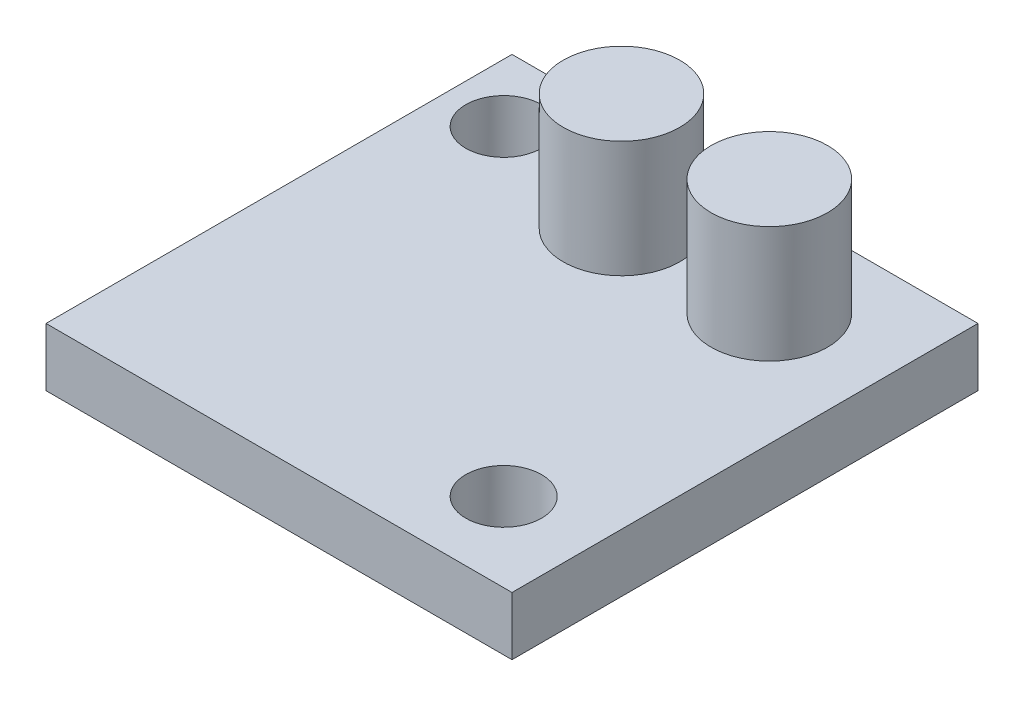
ISO-10303-21;
HEADER;
FILE_DESCRIPTION(('STEP AP214'),'2;1');
FILE_NAME('part.step','',(''),(''),'','','');
FILE_SCHEMA(('AUTOMOTIVE_DESIGN { 1 0 10303 214 1 1 1 1 }'));
ENDSEC;
DATA;
#1=APPLICATION_CONTEXT('core data for automotive mechanical design processes');
#2=APPLICATION_PROTOCOL_DEFINITION('international standard','automotive_design',2000,#1);
#3=PRODUCT_CONTEXT('',#1,'mechanical');
#4=PRODUCT('Part','Part','',(#3));
#5=PRODUCT_RELATED_PRODUCT_CATEGORY('part','',(#4));
#6=PRODUCT_DEFINITION_FORMATION('','',#4);
#7=PRODUCT_DEFINITION_CONTEXT('part definition',#1,'design');
#8=PRODUCT_DEFINITION('design','',#6,#7);
#9=PRODUCT_DEFINITION_SHAPE('','',#8);
#10=(LENGTH_UNIT() NAMED_UNIT(*) SI_UNIT(.MILLI.,.METRE.));
#11=(NAMED_UNIT(*) PLANE_ANGLE_UNIT() SI_UNIT($,.RADIAN.));
#12=(NAMED_UNIT(*) SI_UNIT($,.STERADIAN.) SOLID_ANGLE_UNIT());
#13=UNCERTAINTY_MEASURE_WITH_UNIT(LENGTH_MEASURE(1.E-05),#10,'distance_accuracy_value','');
#14=(GEOMETRIC_REPRESENTATION_CONTEXT(3) GLOBAL_UNCERTAINTY_ASSIGNED_CONTEXT((#13)) GLOBAL_UNIT_ASSIGNED_CONTEXT((#10,
#11,#12)) REPRESENTATION_CONTEXT('',''));
#15=CARTESIAN_POINT('',(0.,0.,0.));
#16=DIRECTION('',(0.,0.,1.));
#17=DIRECTION('',(1.,0.,0.));
#18=AXIS2_PLACEMENT_3D('',#15,#16,#17);
#19=CARTESIAN_POINT('',(0.,2.54,0.));
#20=DIRECTION('',(1.,0.,0.));
#21=DIRECTION('',(0.,0.,-1.));
#22=AXIS2_PLACEMENT_3D('',#19,#20,#21);
#23=PLANE('',#22);
#24=DIRECTION('',(0.,0.,1.));
#25=VECTOR('',#24,1.);
#26=CARTESIAN_POINT('',(0.,0.,0.));
#27=LINE('',#26,#25);
#28=CARTESIAN_POINT('',(0.,0.,-20.32));
#29=VERTEX_POINT('',#28);
#30=CARTESIAN_POINT('',(0.,0.,0.));
#31=VERTEX_POINT('',#30);
#32=EDGE_CURVE('E101',#29,#31,#27,.T.);
#33=ORIENTED_EDGE('',*,*,#32,.T.);
#34=DIRECTION('',(0.,-1.,0.));
#35=VECTOR('',#34,1.);
#36=CARTESIAN_POINT('',(0.,2.54,0.));
#37=LINE('',#36,#35);
#38=CARTESIAN_POINT('',(0.,2.54,0.));
#39=VERTEX_POINT('',#38);
#40=EDGE_CURVE('E92',#39,#31,#37,.T.);
#41=ORIENTED_EDGE('',*,*,#40,.F.);
#42=DIRECTION('',(0.,0.,1.));
#43=VECTOR('',#42,1.);
#44=CARTESIAN_POINT('',(0.,2.54,0.));
#45=LINE('',#44,#43);
#46=CARTESIAN_POINT('',(0.,2.54,-20.32));
#47=VERTEX_POINT('',#46);
#48=EDGE_CURVE('E86',#47,#39,#45,.T.);
#49=ORIENTED_EDGE('',*,*,#48,.F.);
#50=DIRECTION('',(0.,-1.,0.));
#51=VECTOR('',#50,1.);
#52=CARTESIAN_POINT('',(0.,2.54,-20.32));
#53=LINE('',#52,#51);
#54=EDGE_CURVE('E97',#47,#29,#53,.T.);
#55=ORIENTED_EDGE('',*,*,#54,.T.);
#56=EDGE_LOOP('',(#33,#41,#49,#55));
#57=FACE_BOUND('',#56,.T.);
#58=ADVANCED_FACE('F34',(#57),#23,.F.);
#59=CARTESIAN_POINT('',(0.,2.54,0.));
#60=DIRECTION('',(0.,0.,-1.));
#61=DIRECTION('',(-1.,0.,0.));
#62=AXIS2_PLACEMENT_3D('',#59,#60,#61);
#63=PLANE('',#62);
#64=DIRECTION('',(1.,0.,0.));
#65=VECTOR('',#64,1.);
#66=CARTESIAN_POINT('',(0.,0.,0.));
#67=LINE('',#66,#65);
#68=CARTESIAN_POINT('',(20.32,0.,0.));
#69=VERTEX_POINT('',#68);
#70=EDGE_CURVE('E91',#31,#69,#67,.T.);
#71=ORIENTED_EDGE('',*,*,#70,.T.);
#72=DIRECTION('',(0.,-1.,0.));
#73=VECTOR('',#72,1.);
#74=CARTESIAN_POINT('',(20.32,2.54,0.));
#75=LINE('',#74,#73);
#76=CARTESIAN_POINT('',(20.32,2.54,0.));
#77=VERTEX_POINT('',#76);
#78=EDGE_CURVE('E89',#77,#69,#75,.T.);
#79=ORIENTED_EDGE('',*,*,#78,.F.);
#80=DIRECTION('',(1.,0.,0.));
#81=VECTOR('',#80,1.);
#82=CARTESIAN_POINT('',(0.,2.54,0.));
#83=LINE('',#82,#81);
#84=EDGE_CURVE('E81',#39,#77,#83,.T.);
#85=ORIENTED_EDGE('',*,*,#84,.F.);
#86=ORIENTED_EDGE('',*,*,#40,.T.);
#87=EDGE_LOOP('',(#71,#79,#85,#86));
#88=FACE_BOUND('',#87,.T.);
#89=ADVANCED_FACE('F90',(#88),#63,.F.);
#90=CARTESIAN_POINT('',(20.32,2.54,0.));
#91=DIRECTION('',(-1.,0.,0.));
#92=DIRECTION('',(0.,0.,1.));
#93=AXIS2_PLACEMENT_3D('',#90,#91,#92);
#94=PLANE('',#93);
#95=DIRECTION('',(0.,0.,-1.));
#96=VECTOR('',#95,1.);
#97=CARTESIAN_POINT('',(20.32,0.,0.));
#98=LINE('',#97,#96);
#99=CARTESIAN_POINT('',(20.32,0.,-20.32));
#100=VERTEX_POINT('',#99);
#101=EDGE_CURVE('E67',#69,#100,#98,.T.);
#102=ORIENTED_EDGE('',*,*,#101,.T.);
#103=DIRECTION('',(0.,-1.,0.));
#104=VECTOR('',#103,1.);
#105=CARTESIAN_POINT('',(20.32,2.54,-20.32));
#106=LINE('',#105,#104);
#107=CARTESIAN_POINT('',(20.32,2.54,-20.32));
#108=VERTEX_POINT('',#107);
#109=EDGE_CURVE('E93',#108,#100,#106,.T.);
#110=ORIENTED_EDGE('',*,*,#109,.F.);
#111=DIRECTION('',(0.,0.,-1.));
#112=VECTOR('',#111,1.);
#113=CARTESIAN_POINT('',(20.32,2.54,0.));
#114=LINE('',#113,#112);
#115=EDGE_CURVE('E84',#77,#108,#114,.T.);
#116=ORIENTED_EDGE('',*,*,#115,.F.);
#117=ORIENTED_EDGE('',*,*,#78,.T.);
#118=EDGE_LOOP('',(#102,#110,#116,#117));
#119=FACE_BOUND('',#118,.T.);
#120=ADVANCED_FACE('F95',(#119),#94,.F.);
#121=CARTESIAN_POINT('',(0.,2.54,-20.32));
#122=DIRECTION('',(0.,0.,1.));
#123=DIRECTION('',(1.,0.,0.));
#124=AXIS2_PLACEMENT_3D('',#121,#122,#123);
#125=PLANE('',#124);
#126=DIRECTION('',(-1.,0.,0.));
#127=VECTOR('',#126,1.);
#128=CARTESIAN_POINT('',(0.,0.,-20.32));
#129=LINE('',#128,#127);
#130=EDGE_CURVE('E73',#100,#29,#129,.T.);
#131=ORIENTED_EDGE('',*,*,#130,.T.);
#132=ORIENTED_EDGE('',*,*,#54,.F.);
#133=DIRECTION('',(-1.,0.,0.));
#134=VECTOR('',#133,1.);
#135=CARTESIAN_POINT('',(0.,2.54,-20.32));
#136=LINE('',#135,#134);
#137=EDGE_CURVE('E50',#108,#47,#136,.T.);
#138=ORIENTED_EDGE('',*,*,#137,.F.);
#139=ORIENTED_EDGE('',*,*,#109,.T.);
#140=EDGE_LOOP('',(#131,#132,#138,#139));
#141=FACE_BOUND('',#140,.T.);
#142=ADVANCED_FACE('F118',(#141),#125,.F.);
#143=CARTESIAN_POINT('',(0.,2.54,0.));
#144=DIRECTION('',(0.,-1.,0.));
#145=DIRECTION('',(0.,0.,-1.));
#146=AXIS2_PLACEMENT_3D('',#143,#144,#145);
#147=PLANE('',#146);
#148=CARTESIAN_POINT('',(15.3999132319201,2.54,-16.1410851693299));
#149=DIRECTION('',(0.,-1.,0.));
#150=DIRECTION('',(0.,0.,-1.));
#151=AXIS2_PLACEMENT_3D('',#148,#149,#150);
#152=CIRCLE('',#151,2.54);
#153=CARTESIAN_POINT('',(15.3999132319201,2.54,-18.6810851693299));
#154=VERTEX_POINT('',#153);
#155=EDGE_CURVE('E11',#154,#154,#152,.F.);
#156=ORIENTED_EDGE('',*,*,#155,.F.);
#157=EDGE_LOOP('',(#156));
#158=FACE_BOUND('',#157,.T.);
#159=CARTESIAN_POINT('',(8.95344103212366,2.54,-16.1410851693299));
#160=DIRECTION('',(0.,-1.,0.));
#161=DIRECTION('',(0.,0.,-1.));
#162=AXIS2_PLACEMENT_3D('',#159,#160,#161);
#163=CIRCLE('',#162,2.54);
#164=CARTESIAN_POINT('',(8.95344103212366,2.54,-18.6810851693299));
#165=VERTEX_POINT('',#164);
#166=EDGE_CURVE('E42',#165,#165,#163,.F.);
#167=ORIENTED_EDGE('',*,*,#166,.F.);
#168=EDGE_LOOP('',(#167));
#169=FACE_BOUND('',#168,.T.);
#170=CARTESIAN_POINT('',(16.51,2.54,-3.44659036394201));
#171=DIRECTION('',(0.,1.,0.));
#172=DIRECTION('',(0.,0.,1.));
#173=AXIS2_PLACEMENT_3D('',#170,#171,#172);
#174=CIRCLE('',#173,1.651);
#175=CARTESIAN_POINT('',(16.51,2.54,-1.79559036394201));
#176=VERTEX_POINT('',#175);
#177=EDGE_CURVE('E124',#176,#176,#174,.T.);
#178=ORIENTED_EDGE('',*,*,#177,.F.);
#179=EDGE_LOOP('',(#178));
#180=FACE_BOUND('',#179,.T.);
#181=CARTESIAN_POINT('',(2.54,2.54,-17.416590363942));
#182=DIRECTION('',(0.,1.,0.));
#183=DIRECTION('',(0.,0.,1.));
#184=AXIS2_PLACEMENT_3D('',#181,#182,#183);
#185=CIRCLE('',#184,1.651);
#186=CARTESIAN_POINT('',(2.54,2.54,-15.765590363942));
#187=VERTEX_POINT('',#186);
#188=EDGE_CURVE('E104',#187,#187,#185,.T.);
#189=ORIENTED_EDGE('',*,*,#188,.F.);
#190=EDGE_LOOP('',(#189));
#191=FACE_BOUND('',#190,.T.);
#192=ORIENTED_EDGE('',*,*,#48,.T.);
#193=ORIENTED_EDGE('',*,*,#84,.T.);
#194=ORIENTED_EDGE('',*,*,#115,.T.);
#195=ORIENTED_EDGE('',*,*,#137,.T.);
#196=EDGE_LOOP('',(#192,#193,#194,#195));
#197=FACE_BOUND('',#196,.T.);
#198=ADVANCED_FACE('F82',(#158,#169,#180,#191,#197),#147,.F.);
#199=CARTESIAN_POINT('',(0.,0.,0.));
#200=DIRECTION('',(0.,-1.,0.));
#201=DIRECTION('',(0.,0.,-1.));
#202=AXIS2_PLACEMENT_3D('',#199,#200,#201);
#203=PLANE('',#202);
#204=CARTESIAN_POINT('',(16.51,0.,-3.44659036394201));
#205=DIRECTION('',(0.,-1.,0.));
#206=DIRECTION('',(0.,0.,-1.));
#207=AXIS2_PLACEMENT_3D('',#204,#205,#206);
#208=CIRCLE('',#207,1.651);
#209=CARTESIAN_POINT('',(16.51,0.,-5.09759036394201));
#210=VERTEX_POINT('',#209);
#211=EDGE_CURVE('E133',#210,#210,#208,.F.);
#212=ORIENTED_EDGE('',*,*,#211,.T.);
#213=EDGE_LOOP('',(#212));
#214=FACE_BOUND('',#213,.T.);
#215=CARTESIAN_POINT('',(2.54,0.,-17.416590363942));
#216=DIRECTION('',(0.,-1.,0.));
#217=DIRECTION('',(0.,0.,-1.));
#218=AXIS2_PLACEMENT_3D('',#215,#216,#217);
#219=CIRCLE('',#218,1.651);
#220=CARTESIAN_POINT('',(2.54,0.,-19.067590363942));
#221=VERTEX_POINT('',#220);
#222=EDGE_CURVE('E128',#221,#221,#219,.F.);
#223=ORIENTED_EDGE('',*,*,#222,.T.);
#224=EDGE_LOOP('',(#223));
#225=FACE_BOUND('',#224,.T.);
#226=ORIENTED_EDGE('',*,*,#32,.F.);
#227=ORIENTED_EDGE('',*,*,#130,.F.);
#228=ORIENTED_EDGE('',*,*,#101,.F.);
#229=ORIENTED_EDGE('',*,*,#70,.F.);
#230=EDGE_LOOP('',(#226,#227,#228,#229));
#231=FACE_BOUND('',#230,.T.);
#232=ADVANCED_FACE('F117',(#214,#225,#231),#203,.T.);
#233=CARTESIAN_POINT('',(2.54,-0.00100000000000013,-17.416590363942));
#234=DIRECTION('',(0.,1.,0.));
#235=DIRECTION('',(0.,0.,1.));
#236=AXIS2_PLACEMENT_3D('',#233,#234,#235);
#237=CYLINDRICAL_SURFACE('',#236,1.651);
#238=ORIENTED_EDGE('',*,*,#222,.F.);
#239=EDGE_LOOP('',(#238));
#240=FACE_BOUND('',#239,.T.);
#241=ORIENTED_EDGE('',*,*,#188,.T.);
#242=EDGE_LOOP('',(#241));
#243=FACE_BOUND('',#242,.T.);
#244=ADVANCED_FACE('F167',(#240,#243),#237,.F.);
#245=CARTESIAN_POINT('',(16.51,-0.00100000000000013,-3.44659036394201));
#246=DIRECTION('',(0.,1.,0.));
#247=DIRECTION('',(0.,0.,1.));
#248=AXIS2_PLACEMENT_3D('',#245,#246,#247);
#249=CYLINDRICAL_SURFACE('',#248,1.651);
#250=ORIENTED_EDGE('',*,*,#211,.F.);
#251=EDGE_LOOP('',(#250));
#252=FACE_BOUND('',#251,.T.);
#253=ORIENTED_EDGE('',*,*,#177,.T.);
#254=EDGE_LOOP('',(#253));
#255=FACE_BOUND('',#254,.T.);
#256=ADVANCED_FACE('F173',(#252,#255),#249,.F.);
#257=CARTESIAN_POINT('',(8.95344103212366,7.62,-16.1410851693299));
#258=DIRECTION('',(0.,-1.,0.));
#259=DIRECTION('',(0.,0.,-1.));
#260=AXIS2_PLACEMENT_3D('',#257,#258,#259);
#261=CYLINDRICAL_SURFACE('',#260,2.54);
#262=CARTESIAN_POINT('',(8.95344103212366,7.62,-16.1410851693299));
#263=DIRECTION('',(0.,1.,0.));
#264=DIRECTION('',(0.,0.,1.));
#265=AXIS2_PLACEMENT_3D('',#262,#263,#264);
#266=CIRCLE('',#265,2.54);
#267=CARTESIAN_POINT('',(8.95344103212366,7.62,-13.6010851693299));
#268=VERTEX_POINT('',#267);
#269=EDGE_CURVE('E136',#268,#268,#266,.T.);
#270=ORIENTED_EDGE('',*,*,#269,.F.);
#271=EDGE_LOOP('',(#270));
#272=FACE_BOUND('',#271,.T.);
#273=ORIENTED_EDGE('',*,*,#166,.T.);
#274=EDGE_LOOP('',(#273));
#275=FACE_BOUND('',#274,.T.);
#276=ADVANCED_FACE('F113',(#272,#275),#261,.T.);
#277=CARTESIAN_POINT('',(8.95344103212366,7.62,-16.1410851693299));
#278=DIRECTION('',(0.,1.,0.));
#279=DIRECTION('',(0.,0.,1.));
#280=AXIS2_PLACEMENT_3D('',#277,#278,#279);
#281=PLANE('',#280);
#282=ORIENTED_EDGE('',*,*,#269,.T.);
#283=EDGE_LOOP('',(#282));
#284=FACE_BOUND('',#283,.T.);
#285=ADVANCED_FACE('F149',(#284),#281,.T.);
#286=CARTESIAN_POINT('',(15.3999132319201,7.62,-16.1410851693299));
#287=DIRECTION('',(0.,-1.,0.));
#288=DIRECTION('',(0.,0.,-1.));
#289=AXIS2_PLACEMENT_3D('',#286,#287,#288);
#290=CYLINDRICAL_SURFACE('',#289,2.54);
#291=CARTESIAN_POINT('',(15.3999132319201,7.62,-16.1410851693299));
#292=DIRECTION('',(0.,1.,0.));
#293=DIRECTION('',(0.,0.,1.));
#294=AXIS2_PLACEMENT_3D('',#291,#292,#293);
#295=CIRCLE('',#294,2.54);
#296=CARTESIAN_POINT('',(15.3999132319201,7.62,-13.6010851693299));
#297=VERTEX_POINT('',#296);
#298=EDGE_CURVE('E140',#297,#297,#295,.T.);
#299=ORIENTED_EDGE('',*,*,#298,.F.);
#300=EDGE_LOOP('',(#299));
#301=FACE_BOUND('',#300,.T.);
#302=ORIENTED_EDGE('',*,*,#155,.T.);
#303=EDGE_LOOP('',(#302));
#304=FACE_BOUND('',#303,.T.);
#305=ADVANCED_FACE('F146',(#301,#304),#290,.T.);
#306=CARTESIAN_POINT('',(15.3999132319201,7.62,-16.1410851693299));
#307=DIRECTION('',(0.,1.,0.));
#308=DIRECTION('',(0.,0.,1.));
#309=AXIS2_PLACEMENT_3D('',#306,#307,#308);
#310=PLANE('',#309);
#311=ORIENTED_EDGE('',*,*,#298,.T.);
#312=EDGE_LOOP('',(#311));
#313=FACE_BOUND('',#312,.T.);
#314=ADVANCED_FACE('F144',(#313),#310,.T.);
#315=CLOSED_SHELL('',(#58,#89,#120,#142,#198,#232,#244,#256,#276,#285,#305,#314));
#316=MANIFOLD_SOLID_BREP('B2',#315);
#317=ADVANCED_BREP_SHAPE_REPRESENTATION('',(#18,#316),#14);
#318=SHAPE_DEFINITION_REPRESENTATION(#9,#317);
ENDSEC;
END-ISO-10303-21;
